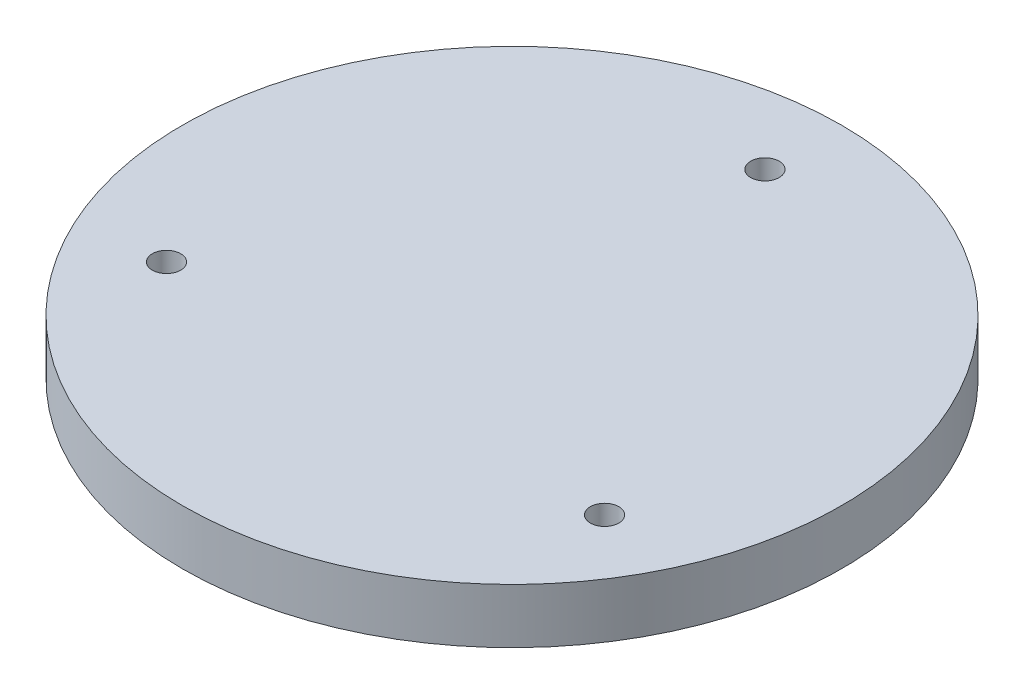
ISO-10303-21;
HEADER;
FILE_DESCRIPTION(('STEP AP214'),'2;1');
FILE_NAME('part.step','',(''),(''),'','','');
FILE_SCHEMA(('AUTOMOTIVE_DESIGN { 1 0 10303 214 1 1 1 1 }'));
ENDSEC;
DATA;
#1=APPLICATION_CONTEXT('core data for automotive mechanical design processes');
#2=APPLICATION_PROTOCOL_DEFINITION('international standard','automotive_design',2000,#1);
#3=PRODUCT_CONTEXT('',#1,'mechanical');
#4=PRODUCT('Part','Part','',(#3));
#5=PRODUCT_RELATED_PRODUCT_CATEGORY('part','',(#4));
#6=PRODUCT_DEFINITION_FORMATION('','',#4);
#7=PRODUCT_DEFINITION_CONTEXT('part definition',#1,'design');
#8=PRODUCT_DEFINITION('design','',#6,#7);
#9=PRODUCT_DEFINITION_SHAPE('','',#8);
#10=(LENGTH_UNIT() NAMED_UNIT(*) SI_UNIT(.MILLI.,.METRE.));
#11=(NAMED_UNIT(*) PLANE_ANGLE_UNIT() SI_UNIT($,.RADIAN.));
#12=(NAMED_UNIT(*) SI_UNIT($,.STERADIAN.) SOLID_ANGLE_UNIT());
#13=UNCERTAINTY_MEASURE_WITH_UNIT(LENGTH_MEASURE(1.E-05),#10,'distance_accuracy_value','');
#14=(GEOMETRIC_REPRESENTATION_CONTEXT(3) GLOBAL_UNCERTAINTY_ASSIGNED_CONTEXT((#13)) GLOBAL_UNIT_ASSIGNED_CONTEXT((#10,
#11,#12)) REPRESENTATION_CONTEXT('',''));
#15=CARTESIAN_POINT('',(0.,0.,0.));
#16=DIRECTION('',(0.,0.,1.));
#17=DIRECTION('',(1.,0.,0.));
#18=AXIS2_PLACEMENT_3D('',#15,#16,#17);
#19=CARTESIAN_POINT('',(0.,6.35,0.));
#20=DIRECTION('',(0.,-1.,0.));
#21=DIRECTION('',(0.,0.,-1.));
#22=AXIS2_PLACEMENT_3D('',#19,#20,#21);
#23=CYLINDRICAL_SURFACE('',#22,38.227);
#24=CARTESIAN_POINT('',(0.,6.35,0.));
#25=DIRECTION('',(0.,1.,0.));
#26=DIRECTION('',(0.,0.,1.));
#27=AXIS2_PLACEMENT_3D('',#24,#25,#26);
#28=CIRCLE('',#27,38.227);
#29=CARTESIAN_POINT('',(0.,6.35,38.227));
#30=VERTEX_POINT('',#29);
#31=EDGE_CURVE('E10',#30,#30,#28,.T.);
#32=ORIENTED_EDGE('',*,*,#31,.F.);
#33=EDGE_LOOP('',(#32));
#34=FACE_BOUND('',#33,.T.);
#35=CARTESIAN_POINT('',(0.,0.,0.));
#36=DIRECTION('',(0.,1.,0.));
#37=DIRECTION('',(0.,0.,1.));
#38=AXIS2_PLACEMENT_3D('',#35,#36,#37);
#39=CIRCLE('',#38,38.227);
#40=CARTESIAN_POINT('',(0.,0.,38.227));
#41=VERTEX_POINT('',#40);
#42=EDGE_CURVE('E35',#41,#41,#39,.T.);
#43=ORIENTED_EDGE('',*,*,#42,.T.);
#44=EDGE_LOOP('',(#43));
#45=FACE_BOUND('',#44,.T.);
#46=ADVANCED_FACE('F32',(#34,#45),#23,.T.);
#47=CARTESIAN_POINT('',(0.,6.35,0.));
#48=DIRECTION('',(0.,1.,0.));
#49=DIRECTION('',(0.,0.,1.));
#50=AXIS2_PLACEMENT_3D('',#47,#48,#49);
#51=PLANE('',#50);
#52=CARTESIAN_POINT('',(0.,6.35,-29.337));
#53=DIRECTION('',(0.,1.,0.));
#54=DIRECTION('',(0.,0.,1.));
#55=AXIS2_PLACEMENT_3D('',#52,#53,#54);
#56=CIRCLE('',#55,1.651);
#57=CARTESIAN_POINT('',(0.,6.35,-27.686));
#58=VERTEX_POINT('',#57);
#59=EDGE_CURVE('E56',#58,#58,#56,.T.);
#60=ORIENTED_EDGE('',*,*,#59,.F.);
#61=EDGE_LOOP('',(#60));
#62=FACE_BOUND('',#61,.T.);
#63=CARTESIAN_POINT('',(25.4065872708259,6.35,14.668499999999));
#64=DIRECTION('',(0.,1.,0.));
#65=DIRECTION('',(0.,0.,1.));
#66=AXIS2_PLACEMENT_3D('',#63,#64,#65);
#67=CIRCLE('',#66,1.651);
#68=CARTESIAN_POINT('',(25.4065872708259,6.35,16.319499999999));
#69=VERTEX_POINT('',#68);
#70=EDGE_CURVE('E50',#69,#69,#67,.T.);
#71=ORIENTED_EDGE('',*,*,#70,.F.);
#72=EDGE_LOOP('',(#71));
#73=FACE_BOUND('',#72,.T.);
#74=CARTESIAN_POINT('',(-25.4065872708223,6.35,14.668500000001));
#75=DIRECTION('',(0.,1.,0.));
#76=DIRECTION('',(0.,0.,1.));
#77=AXIS2_PLACEMENT_3D('',#74,#75,#76);
#78=CIRCLE('',#77,1.651);
#79=CARTESIAN_POINT('',(-25.4065872708223,6.35,16.319500000001));
#80=VERTEX_POINT('',#79);
#81=EDGE_CURVE('E44',#80,#80,#78,.T.);
#82=ORIENTED_EDGE('',*,*,#81,.F.);
#83=EDGE_LOOP('',(#82));
#84=FACE_BOUND('',#83,.T.);
#85=ORIENTED_EDGE('',*,*,#31,.T.);
#86=EDGE_LOOP('',(#85));
#87=FACE_BOUND('',#86,.T.);
#88=ADVANCED_FACE('F72',(#62,#73,#84,#87),#51,.T.);
#89=CARTESIAN_POINT('',(0.,0.,0.));
#90=DIRECTION('',(0.,1.,0.));
#91=DIRECTION('',(0.,0.,1.));
#92=AXIS2_PLACEMENT_3D('',#89,#90,#91);
#93=PLANE('',#92);
#94=CARTESIAN_POINT('',(0.,0.,-29.337));
#95=DIRECTION('',(0.,1.,0.));
#96=DIRECTION('',(0.,0.,1.));
#97=AXIS2_PLACEMENT_3D('',#94,#95,#96);
#98=CIRCLE('',#97,1.651);
#99=CARTESIAN_POINT('',(0.,0.,-27.686));
#100=VERTEX_POINT('',#99);
#101=EDGE_CURVE('E42',#100,#100,#98,.T.);
#102=ORIENTED_EDGE('',*,*,#101,.T.);
#103=EDGE_LOOP('',(#102));
#104=FACE_BOUND('',#103,.T.);
#105=CARTESIAN_POINT('',(25.4065872708259,0.,14.668499999999));
#106=DIRECTION('',(0.,1.,0.));
#107=DIRECTION('',(0.,0.,1.));
#108=AXIS2_PLACEMENT_3D('',#105,#106,#107);
#109=CIRCLE('',#108,1.651);
#110=CARTESIAN_POINT('',(25.4065872708259,0.,16.319499999999));
#111=VERTEX_POINT('',#110);
#112=EDGE_CURVE('E53',#111,#111,#109,.T.);
#113=ORIENTED_EDGE('',*,*,#112,.T.);
#114=EDGE_LOOP('',(#113));
#115=FACE_BOUND('',#114,.T.);
#116=CARTESIAN_POINT('',(-25.4065872708223,0.,14.668500000001));
#117=DIRECTION('',(0.,1.,0.));
#118=DIRECTION('',(0.,0.,1.));
#119=AXIS2_PLACEMENT_3D('',#116,#117,#118);
#120=CIRCLE('',#119,1.651);
#121=CARTESIAN_POINT('',(-25.4065872708223,0.,16.319500000001));
#122=VERTEX_POINT('',#121);
#123=EDGE_CURVE('E47',#122,#122,#120,.T.);
#124=ORIENTED_EDGE('',*,*,#123,.T.);
#125=EDGE_LOOP('',(#124));
#126=FACE_BOUND('',#125,.T.);
#127=ORIENTED_EDGE('',*,*,#42,.F.);
#128=EDGE_LOOP('',(#127));
#129=FACE_BOUND('',#128,.T.);
#130=ADVANCED_FACE('F62',(#104,#115,#126,#129),#93,.F.);
#131=CARTESIAN_POINT('',(-25.4065872708223,0.,14.668500000001));
#132=DIRECTION('',(0.,1.,0.));
#133=DIRECTION('',(0.,0.,1.));
#134=AXIS2_PLACEMENT_3D('',#131,#132,#133);
#135=CYLINDRICAL_SURFACE('',#134,1.651);
#136=ORIENTED_EDGE('',*,*,#123,.F.);
#137=EDGE_LOOP('',(#136));
#138=FACE_BOUND('',#137,.T.);
#139=ORIENTED_EDGE('',*,*,#81,.T.);
#140=EDGE_LOOP('',(#139));
#141=FACE_BOUND('',#140,.T.);
#142=ADVANCED_FACE('F80',(#138,#141),#135,.F.);
#143=CARTESIAN_POINT('',(25.4065872708259,0.,14.668499999999));
#144=DIRECTION('',(0.,1.,0.));
#145=DIRECTION('',(0.,0.,1.));
#146=AXIS2_PLACEMENT_3D('',#143,#144,#145);
#147=CYLINDRICAL_SURFACE('',#146,1.651);
#148=ORIENTED_EDGE('',*,*,#112,.F.);
#149=EDGE_LOOP('',(#148));
#150=FACE_BOUND('',#149,.T.);
#151=ORIENTED_EDGE('',*,*,#70,.T.);
#152=EDGE_LOOP('',(#151));
#153=FACE_BOUND('',#152,.T.);
#154=ADVANCED_FACE('F68',(#150,#153),#147,.F.);
#155=CARTESIAN_POINT('',(0.,0.,-29.337));
#156=DIRECTION('',(0.,1.,0.));
#157=DIRECTION('',(0.,0.,1.));
#158=AXIS2_PLACEMENT_3D('',#155,#156,#157);
#159=CYLINDRICAL_SURFACE('',#158,1.651);
#160=ORIENTED_EDGE('',*,*,#101,.F.);
#161=EDGE_LOOP('',(#160));
#162=FACE_BOUND('',#161,.T.);
#163=ORIENTED_EDGE('',*,*,#59,.T.);
#164=EDGE_LOOP('',(#163));
#165=FACE_BOUND('',#164,.T.);
#166=ADVANCED_FACE('F65',(#162,#165),#159,.F.);
#167=CLOSED_SHELL('',(#46,#88,#130,#142,#154,#166));
#168=MANIFOLD_SOLID_BREP('B2',#167);
#169=ADVANCED_BREP_SHAPE_REPRESENTATION('',(#18,#168),#14);
#170=SHAPE_DEFINITION_REPRESENTATION(#9,#169);
ENDSEC;
END-ISO-10303-21;
